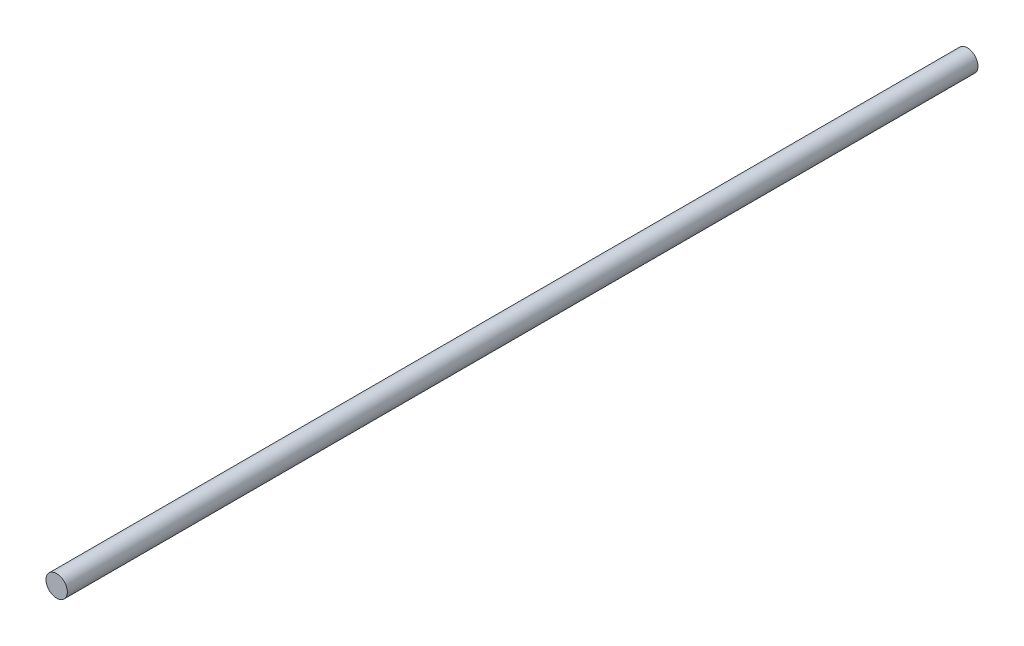
ISO-10303-21;
HEADER;
FILE_DESCRIPTION(('STEP AP214'),'2;1');
FILE_NAME('part.step','',(''),(''),'','','');
FILE_SCHEMA(('AUTOMOTIVE_DESIGN { 1 0 10303 214 1 1 1 1 }'));
ENDSEC;
DATA;
#1=APPLICATION_CONTEXT('core data for automotive mechanical design processes');
#2=APPLICATION_PROTOCOL_DEFINITION('international standard','automotive_design',2000,#1);
#3=PRODUCT_CONTEXT('',#1,'mechanical');
#4=PRODUCT('Part','Part','',(#3));
#5=PRODUCT_RELATED_PRODUCT_CATEGORY('part','',(#4));
#6=PRODUCT_DEFINITION_FORMATION('','',#4);
#7=PRODUCT_DEFINITION_CONTEXT('part definition',#1,'design');
#8=PRODUCT_DEFINITION('design','',#6,#7);
#9=PRODUCT_DEFINITION_SHAPE('','',#8);
#10=(LENGTH_UNIT() NAMED_UNIT(*) SI_UNIT(.MILLI.,.METRE.));
#11=(NAMED_UNIT(*) PLANE_ANGLE_UNIT() SI_UNIT($,.RADIAN.));
#12=(NAMED_UNIT(*) SI_UNIT($,.STERADIAN.) SOLID_ANGLE_UNIT());
#13=UNCERTAINTY_MEASURE_WITH_UNIT(LENGTH_MEASURE(1.E-05),#10,'distance_accuracy_value','');
#14=(GEOMETRIC_REPRESENTATION_CONTEXT(3) GLOBAL_UNCERTAINTY_ASSIGNED_CONTEXT((#13)) GLOBAL_UNIT_ASSIGNED_CONTEXT((#10,
#11,#12)) REPRESENTATION_CONTEXT('',''));
#15=CARTESIAN_POINT('',(0.,0.,0.));
#16=DIRECTION('',(0.,0.,1.));
#17=DIRECTION('',(1.,0.,0.));
#18=AXIS2_PLACEMENT_3D('',#15,#16,#17);
#19=CARTESIAN_POINT('',(0.,0.,203.2));
#20=DIRECTION('',(0.,0.,-1.));
#21=DIRECTION('',(-1.,0.,0.));
#22=AXIS2_PLACEMENT_3D('',#19,#20,#21);
#23=CYLINDRICAL_SURFACE('',#22,2.38125);
#24=CARTESIAN_POINT('',(0.,0.,203.2));
#25=DIRECTION('',(0.,0.,1.));
#26=DIRECTION('',(1.,0.,0.));
#27=AXIS2_PLACEMENT_3D('',#24,#25,#26);
#28=CIRCLE('',#27,2.38125);
#29=CARTESIAN_POINT('',(2.38125,0.,203.2));
#30=VERTEX_POINT('',#29);
#31=EDGE_CURVE('E10',#30,#30,#28,.T.);
#32=ORIENTED_EDGE('',*,*,#31,.F.);
#33=EDGE_LOOP('',(#32));
#34=FACE_BOUND('',#33,.T.);
#35=CARTESIAN_POINT('',(0.,0.,0.));
#36=DIRECTION('',(0.,0.,1.));
#37=DIRECTION('',(1.,0.,0.));
#38=AXIS2_PLACEMENT_3D('',#35,#36,#37);
#39=CIRCLE('',#38,2.38125);
#40=CARTESIAN_POINT('',(2.38125,0.,0.));
#41=VERTEX_POINT('',#40);
#42=EDGE_CURVE('E34',#41,#41,#39,.T.);
#43=ORIENTED_EDGE('',*,*,#42,.T.);
#44=EDGE_LOOP('',(#43));
#45=FACE_BOUND('',#44,.T.);
#46=ADVANCED_FACE('F31',(#34,#45),#23,.T.);
#47=CARTESIAN_POINT('',(0.,0.,203.2));
#48=DIRECTION('',(0.,0.,1.));
#49=DIRECTION('',(1.,0.,0.));
#50=AXIS2_PLACEMENT_3D('',#47,#48,#49);
#51=PLANE('',#50);
#52=ORIENTED_EDGE('',*,*,#31,.T.);
#53=EDGE_LOOP('',(#52));
#54=FACE_BOUND('',#53,.T.);
#55=ADVANCED_FACE('F46',(#54),#51,.T.);
#56=CARTESIAN_POINT('',(0.,0.,0.));
#57=DIRECTION('',(0.,0.,1.));
#58=DIRECTION('',(1.,0.,0.));
#59=AXIS2_PLACEMENT_3D('',#56,#57,#58);
#60=PLANE('',#59);
#61=ORIENTED_EDGE('',*,*,#42,.F.);
#62=EDGE_LOOP('',(#61));
#63=FACE_BOUND('',#62,.T.);
#64=ADVANCED_FACE('F44',(#63),#60,.F.);
#65=CLOSED_SHELL('',(#46,#55,#64));
#66=MANIFOLD_SOLID_BREP('B2',#65);
#67=ADVANCED_BREP_SHAPE_REPRESENTATION('',(#18,#66),#14);
#68=SHAPE_DEFINITION_REPRESENTATION(#9,#67);
ENDSEC;
END-ISO-10303-21;
